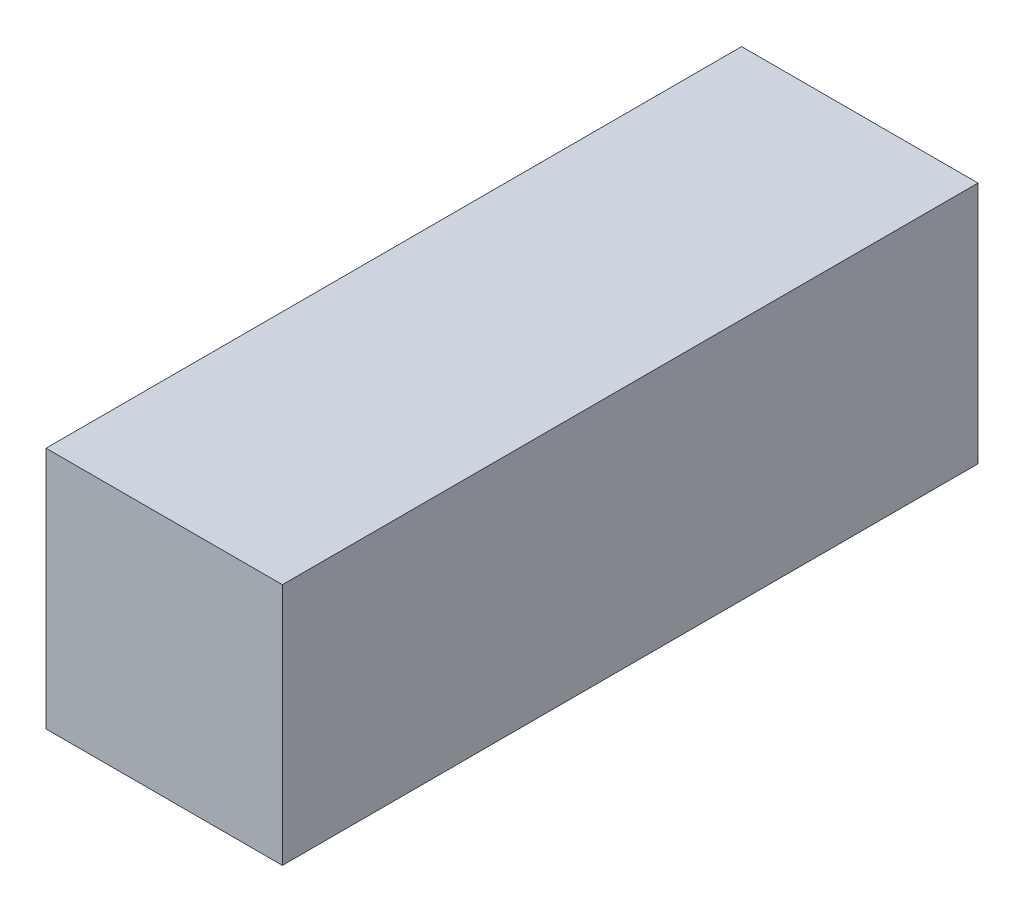
ISO-10303-21;
HEADER;
FILE_DESCRIPTION(('STEP AP214'),'2;1');
FILE_NAME('part.step','',(''),(''),'','','');
FILE_SCHEMA(('AUTOMOTIVE_DESIGN { 1 0 10303 214 1 1 1 1 }'));
ENDSEC;
DATA;
#1=APPLICATION_CONTEXT('core data for automotive mechanical design processes');
#2=APPLICATION_PROTOCOL_DEFINITION('international standard','automotive_design',2000,#1);
#3=PRODUCT_CONTEXT('',#1,'mechanical');
#4=PRODUCT('Part','Part','',(#3));
#5=PRODUCT_RELATED_PRODUCT_CATEGORY('part','',(#4));
#6=PRODUCT_DEFINITION_FORMATION('','',#4);
#7=PRODUCT_DEFINITION_CONTEXT('part definition',#1,'design');
#8=PRODUCT_DEFINITION('design','',#6,#7);
#9=PRODUCT_DEFINITION_SHAPE('','',#8);
#10=(LENGTH_UNIT() NAMED_UNIT(*) SI_UNIT(.MILLI.,.METRE.));
#11=(NAMED_UNIT(*) PLANE_ANGLE_UNIT() SI_UNIT($,.RADIAN.));
#12=(NAMED_UNIT(*) SI_UNIT($,.STERADIAN.) SOLID_ANGLE_UNIT());
#13=UNCERTAINTY_MEASURE_WITH_UNIT(LENGTH_MEASURE(1.E-05),#10,'distance_accuracy_value','');
#14=(GEOMETRIC_REPRESENTATION_CONTEXT(3) GLOBAL_UNCERTAINTY_ASSIGNED_CONTEXT((#13)) GLOBAL_UNIT_ASSIGNED_CONTEXT((#10,
#11,#12)) REPRESENTATION_CONTEXT('',''));
#15=CARTESIAN_POINT('',(0.,0.,0.));
#16=DIRECTION('',(0.,0.,1.));
#17=DIRECTION('',(1.,0.,0.));
#18=AXIS2_PLACEMENT_3D('',#15,#16,#17);
#19=CARTESIAN_POINT('',(17.5,-18.,103.));
#20=DIRECTION('',(-1.,0.,0.));
#21=DIRECTION('',(0.,0.,1.));
#22=AXIS2_PLACEMENT_3D('',#19,#20,#21);
#23=PLANE('',#22);
#24=DIRECTION('',(0.,1.,0.));
#25=VECTOR('',#24,1.);
#26=CARTESIAN_POINT('',(17.5,-18.,0.));
#27=LINE('',#26,#25);
#28=CARTESIAN_POINT('',(17.5,-18.,0.));
#29=VERTEX_POINT('',#28);
#30=CARTESIAN_POINT('',(17.5,18.,0.));
#31=VERTEX_POINT('',#30);
#32=EDGE_CURVE('E96',#29,#31,#27,.T.);
#33=ORIENTED_EDGE('',*,*,#32,.T.);
#34=DIRECTION('',(0.,0.,-1.));
#35=VECTOR('',#34,1.);
#36=CARTESIAN_POINT('',(17.5,18.,103.));
#37=LINE('',#36,#35);
#38=CARTESIAN_POINT('',(17.5,18.,103.));
#39=VERTEX_POINT('',#38);
#40=EDGE_CURVE('E11',#39,#31,#37,.T.);
#41=ORIENTED_EDGE('',*,*,#40,.F.);
#42=DIRECTION('',(0.,1.,0.));
#43=VECTOR('',#42,1.);
#44=CARTESIAN_POINT('',(17.5,-18.,103.));
#45=LINE('',#44,#43);
#46=CARTESIAN_POINT('',(17.5,-18.,103.));
#47=VERTEX_POINT('',#46);
#48=EDGE_CURVE('E84',#47,#39,#45,.T.);
#49=ORIENTED_EDGE('',*,*,#48,.F.);
#50=DIRECTION('',(0.,0.,-1.));
#51=VECTOR('',#50,1.);
#52=CARTESIAN_POINT('',(17.5,-18.,103.));
#53=LINE('',#52,#51);
#54=EDGE_CURVE('E92',#47,#29,#53,.T.);
#55=ORIENTED_EDGE('',*,*,#54,.T.);
#56=EDGE_LOOP('',(#33,#41,#49,#55));
#57=FACE_BOUND('',#56,.T.);
#58=ADVANCED_FACE('F33',(#57),#23,.F.);
#59=CARTESIAN_POINT('',(-17.5,18.,103.));
#60=DIRECTION('',(0.,-1.,0.));
#61=DIRECTION('',(0.,0.,-1.));
#62=AXIS2_PLACEMENT_3D('',#59,#60,#61);
#63=PLANE('',#62);
#64=DIRECTION('',(-1.,0.,0.));
#65=VECTOR('',#64,1.);
#66=CARTESIAN_POINT('',(-17.5,18.,0.));
#67=LINE('',#66,#65);
#68=CARTESIAN_POINT('',(-17.5,18.,0.));
#69=VERTEX_POINT('',#68);
#70=EDGE_CURVE('E88',#31,#69,#67,.T.);
#71=ORIENTED_EDGE('',*,*,#70,.T.);
#72=DIRECTION('',(0.,0.,-1.));
#73=VECTOR('',#72,1.);
#74=CARTESIAN_POINT('',(-17.5,18.,103.));
#75=LINE('',#74,#73);
#76=CARTESIAN_POINT('',(-17.5,18.,103.));
#77=VERTEX_POINT('',#76);
#78=EDGE_CURVE('E41',#77,#69,#75,.T.);
#79=ORIENTED_EDGE('',*,*,#78,.F.);
#80=DIRECTION('',(-1.,0.,0.));
#81=VECTOR('',#80,1.);
#82=CARTESIAN_POINT('',(-17.5,18.,103.));
#83=LINE('',#82,#81);
#84=EDGE_CURVE('E79',#39,#77,#83,.T.);
#85=ORIENTED_EDGE('',*,*,#84,.F.);
#86=ORIENTED_EDGE('',*,*,#40,.T.);
#87=EDGE_LOOP('',(#71,#79,#85,#86));
#88=FACE_BOUND('',#87,.T.);
#89=ADVANCED_FACE('F87',(#88),#63,.F.);
#90=CARTESIAN_POINT('',(-17.5,-18.,103.));
#91=DIRECTION('',(1.,0.,0.));
#92=DIRECTION('',(0.,0.,-1.));
#93=AXIS2_PLACEMENT_3D('',#90,#91,#92);
#94=PLANE('',#93);
#95=DIRECTION('',(0.,-1.,0.));
#96=VECTOR('',#95,1.);
#97=CARTESIAN_POINT('',(-17.5,-18.,0.));
#98=LINE('',#97,#96);
#99=CARTESIAN_POINT('',(-17.5,-18.,0.));
#100=VERTEX_POINT('',#99);
#101=EDGE_CURVE('E66',#69,#100,#98,.T.);
#102=ORIENTED_EDGE('',*,*,#101,.T.);
#103=DIRECTION('',(0.,0.,-1.));
#104=VECTOR('',#103,1.);
#105=CARTESIAN_POINT('',(-17.5,-18.,103.));
#106=LINE('',#105,#104);
#107=CARTESIAN_POINT('',(-17.5,-18.,103.));
#108=VERTEX_POINT('',#107);
#109=EDGE_CURVE('E89',#108,#100,#106,.T.);
#110=ORIENTED_EDGE('',*,*,#109,.F.);
#111=DIRECTION('',(0.,-1.,0.));
#112=VECTOR('',#111,1.);
#113=CARTESIAN_POINT('',(-17.5,-18.,103.));
#114=LINE('',#113,#112);
#115=EDGE_CURVE('E82',#77,#108,#114,.T.);
#116=ORIENTED_EDGE('',*,*,#115,.F.);
#117=ORIENTED_EDGE('',*,*,#78,.T.);
#118=EDGE_LOOP('',(#102,#110,#116,#117));
#119=FACE_BOUND('',#118,.T.);
#120=ADVANCED_FACE('F90',(#119),#94,.F.);
#121=CARTESIAN_POINT('',(-17.5,-18.,103.));
#122=DIRECTION('',(0.,1.,0.));
#123=DIRECTION('',(0.,0.,1.));
#124=AXIS2_PLACEMENT_3D('',#121,#122,#123);
#125=PLANE('',#124);
#126=DIRECTION('',(1.,0.,0.));
#127=VECTOR('',#126,1.);
#128=CARTESIAN_POINT('',(-17.5,-18.,0.));
#129=LINE('',#128,#127);
#130=EDGE_CURVE('E72',#100,#29,#129,.T.);
#131=ORIENTED_EDGE('',*,*,#130,.T.);
#132=ORIENTED_EDGE('',*,*,#54,.F.);
#133=DIRECTION('',(1.,0.,0.));
#134=VECTOR('',#133,1.);
#135=CARTESIAN_POINT('',(-17.5,-18.,103.));
#136=LINE('',#135,#134);
#137=EDGE_CURVE('E49',#108,#47,#136,.T.);
#138=ORIENTED_EDGE('',*,*,#137,.F.);
#139=ORIENTED_EDGE('',*,*,#109,.T.);
#140=EDGE_LOOP('',(#131,#132,#138,#139));
#141=FACE_BOUND('',#140,.T.);
#142=ADVANCED_FACE('F103',(#141),#125,.F.);
#143=CARTESIAN_POINT('',(0.,0.,103.));
#144=DIRECTION('',(0.,0.,-1.));
#145=DIRECTION('',(-1.,0.,0.));
#146=AXIS2_PLACEMENT_3D('',#143,#144,#145);
#147=PLANE('',#146);
#148=ORIENTED_EDGE('',*,*,#48,.T.);
#149=ORIENTED_EDGE('',*,*,#84,.T.);
#150=ORIENTED_EDGE('',*,*,#115,.T.);
#151=ORIENTED_EDGE('',*,*,#137,.T.);
#152=EDGE_LOOP('',(#148,#149,#150,#151));
#153=FACE_BOUND('',#152,.T.);
#154=ADVANCED_FACE('F80',(#153),#147,.F.);
#155=CARTESIAN_POINT('',(0.,0.,0.));
#156=DIRECTION('',(0.,0.,-1.));
#157=DIRECTION('',(-1.,0.,0.));
#158=AXIS2_PLACEMENT_3D('',#155,#156,#157);
#159=PLANE('',#158);
#160=ORIENTED_EDGE('',*,*,#32,.F.);
#161=ORIENTED_EDGE('',*,*,#130,.F.);
#162=ORIENTED_EDGE('',*,*,#101,.F.);
#163=ORIENTED_EDGE('',*,*,#70,.F.);
#164=EDGE_LOOP('',(#160,#161,#162,#163));
#165=FACE_BOUND('',#164,.T.);
#166=ADVANCED_FACE('F106',(#165),#159,.T.);
#167=CLOSED_SHELL('',(#58,#89,#120,#142,#154,#166));
#168=MANIFOLD_SOLID_BREP('B2',#167);
#169=ADVANCED_BREP_SHAPE_REPRESENTATION('',(#18,#168),#14);
#170=SHAPE_DEFINITION_REPRESENTATION(#9,#169);
ENDSEC;
END-ISO-10303-21;
